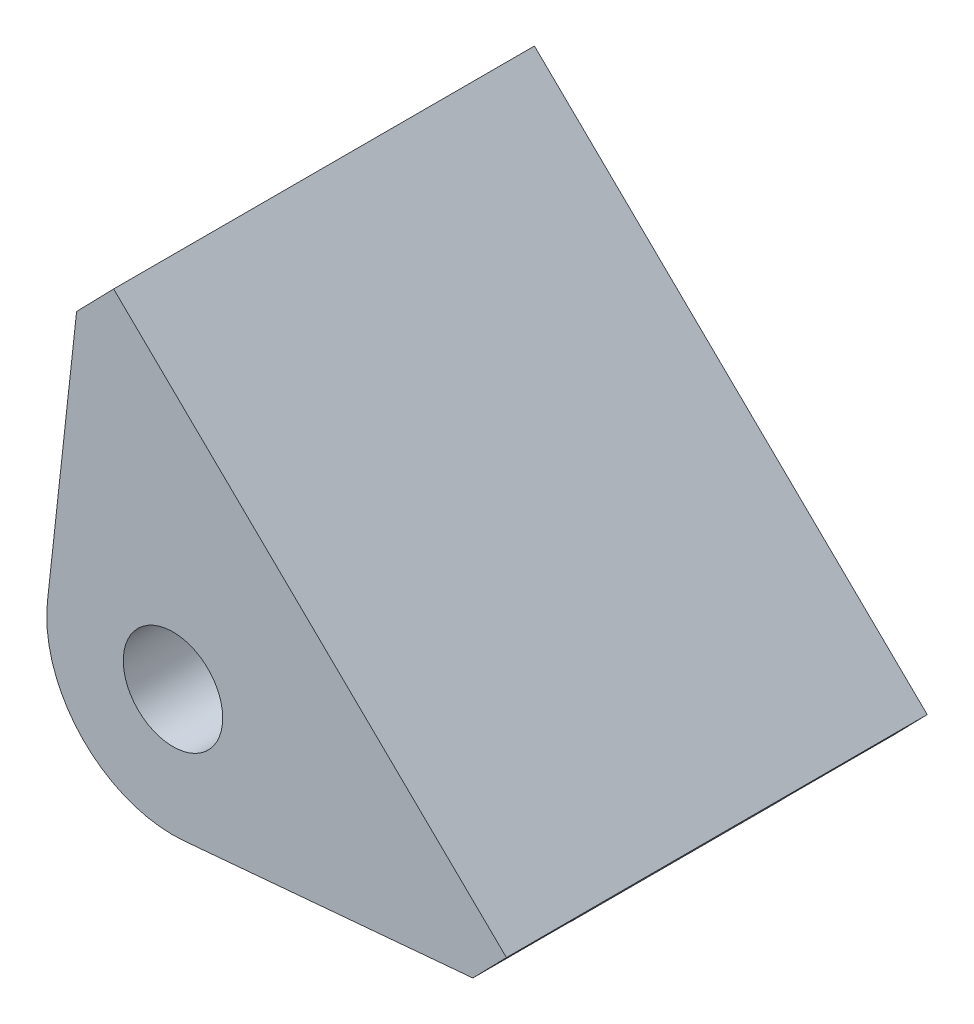
ISO-10303-21;
HEADER;
FILE_DESCRIPTION(('STEP AP214'),'2;1');
FILE_NAME('part.step','',(''),(''),'','','');
FILE_SCHEMA(('AUTOMOTIVE_DESIGN { 1 0 10303 214 1 1 1 1 }'));
ENDSEC;
DATA;
#1=APPLICATION_CONTEXT('core data for automotive mechanical design processes');
#2=APPLICATION_PROTOCOL_DEFINITION('international standard','automotive_design',2000,#1);
#3=PRODUCT_CONTEXT('',#1,'mechanical');
#4=PRODUCT('Part','Part','',(#3));
#5=PRODUCT_RELATED_PRODUCT_CATEGORY('part','',(#4));
#6=PRODUCT_DEFINITION_FORMATION('','',#4);
#7=PRODUCT_DEFINITION_CONTEXT('part definition',#1,'design');
#8=PRODUCT_DEFINITION('design','',#6,#7);
#9=PRODUCT_DEFINITION_SHAPE('','',#8);
#10=(LENGTH_UNIT() NAMED_UNIT(*) SI_UNIT(.MILLI.,.METRE.));
#11=(NAMED_UNIT(*) PLANE_ANGLE_UNIT() SI_UNIT($,.RADIAN.));
#12=(NAMED_UNIT(*) SI_UNIT($,.STERADIAN.) SOLID_ANGLE_UNIT());
#13=UNCERTAINTY_MEASURE_WITH_UNIT(LENGTH_MEASURE(1.E-05),#10,'distance_accuracy_value','');
#14=(GEOMETRIC_REPRESENTATION_CONTEXT(3) GLOBAL_UNCERTAINTY_ASSIGNED_CONTEXT((#13)) GLOBAL_UNIT_ASSIGNED_CONTEXT((#10,
#11,#12)) REPRESENTATION_CONTEXT('',''));
#15=CARTESIAN_POINT('',(0.,0.,0.));
#16=DIRECTION('',(0.,0.,1.));
#17=DIRECTION('',(1.,0.,0.));
#18=AXIS2_PLACEMENT_3D('',#15,#16,#17);
#19=CARTESIAN_POINT('',(-1485.6042340295,163.072759468048,12.7));
#20=DIRECTION('',(0.994029324943426,-0.109113249207034,0.));
#21=DIRECTION('',(0.109113249207034,0.994029324943426,0.));
#22=AXIS2_PLACEMENT_3D('',#19,#20,#21);
#23=PLANE('',#22);
#24=DIRECTION('',(0.,0.,1.));
#25=VECTOR('',#24,1.);
#26=CARTESIAN_POINT('',(-1426.53429907926,701.20399458166,12.7));
#27=LINE('',#26,#25);
#28=CARTESIAN_POINT('',(-1426.53429907926,701.20399458166,0.));
#29=VERTEX_POINT('',#28);
#30=CARTESIAN_POINT('',(-1426.53429907926,701.203994581659,12.7));
#31=VERTEX_POINT('',#30);
#32=EDGE_CURVE('E55',#29,#31,#27,.T.);
#33=ORIENTED_EDGE('',*,*,#32,.F.);
#34=DIRECTION('',(-0.109113249207034,-0.994029324943426,0.));
#35=VECTOR('',#34,1.);
#36=CARTESIAN_POINT('',(-1485.6042340295,163.072759468048,0.));
#37=LINE('',#36,#35);
#38=CARTESIAN_POINT('',(-1426.64108778726,700.231141989519,0.));
#39=VERTEX_POINT('',#38);
#40=EDGE_CURVE('E235',#29,#39,#37,.T.);
#41=ORIENTED_EDGE('',*,*,#40,.T.);
#42=CARTESIAN_POINT('',(-1430.04928785572,669.182201206105,0.));
#43=VERTEX_POINT('',#42);
#44=EDGE_CURVE('E220',#39,#43,#37,.T.);
#45=ORIENTED_EDGE('',*,*,#44,.T.);
#46=DIRECTION('',(0.,0.,-1.));
#47=VECTOR('',#46,1.);
#48=CARTESIAN_POINT('',(-1430.04928785572,669.182201206105,12.7));
#49=LINE('',#48,#47);
#50=CARTESIAN_POINT('',(-1430.04928785572,669.182201206105,12.7));
#51=VERTEX_POINT('',#50);
#52=EDGE_CURVE('E245',#51,#43,#49,.T.);
#53=ORIENTED_EDGE('',*,*,#52,.F.);
#54=DIRECTION('',(-0.109113249207034,-0.994029324943426,0.));
#55=VECTOR('',#54,1.);
#56=CARTESIAN_POINT('',(-1485.6042340295,163.072759468048,12.7));
#57=LINE('',#56,#55);
#58=EDGE_CURVE('E221',#31,#51,#57,.T.);
#59=ORIENTED_EDGE('',*,*,#58,.F.);
#60=EDGE_LOOP('',(#33,#41,#45,#53,#59));
#61=FACE_BOUND('',#60,.T.);
#62=ADVANCED_FACE('F41',(#61),#23,.F.);
#63=CARTESIAN_POINT('',(-339.597460900784,-348.630615295482,12.7));
#64=DIRECTION('',(-0.697765739297027,-0.716326024281732,0.));
#65=DIRECTION('',(0.716326024281732,-0.697765739297027,0.));
#66=AXIS2_PLACEMENT_3D('',#63,#64,#65);
#67=PLANE('',#66);
#68=DIRECTION('',(-0.716326024281732,0.697765739297027,0.));
#69=VECTOR('',#68,1.);
#70=CARTESIAN_POINT('',(-339.597460900784,-348.630615295482,12.7));
#71=LINE('',#70,#69);
#72=CARTESIAN_POINT('',(-1374.64541926335,659.598849212548,12.7));
#73=VERTEX_POINT('',#72);
#74=CARTESIAN_POINT('',(-1422.0662020708,705.790941154011,12.7));
#75=VERTEX_POINT('',#74);
#76=EDGE_CURVE('E145',#73,#75,#71,.T.);
#77=ORIENTED_EDGE('',*,*,#76,.F.);
#78=DIRECTION('',(0.,0.,1.));
#79=VECTOR('',#78,1.);
#80=CARTESIAN_POINT('',(-1374.64541926335,659.598849212548,-25.4));
#81=LINE('',#80,#79);
#82=CARTESIAN_POINT('',(-1374.64541926335,659.598849212548,-38.1));
#83=VERTEX_POINT('',#82);
#84=EDGE_CURVE('E139',#83,#73,#81,.T.);
#85=ORIENTED_EDGE('',*,*,#84,.F.);
#86=DIRECTION('',(-0.716326024281732,0.697765739297027,0.));
#87=VECTOR('',#86,1.);
#88=CARTESIAN_POINT('',(-339.597460900784,-348.630615295482,-38.1));
#89=LINE('',#88,#87);
#90=CARTESIAN_POINT('',(-1422.0662020708,705.790941154011,-38.1));
#91=VERTEX_POINT('',#90);
#92=EDGE_CURVE('E143',#83,#91,#89,.T.);
#93=ORIENTED_EDGE('',*,*,#92,.T.);
#94=DIRECTION('',(0.,0.,1.));
#95=VECTOR('',#94,1.);
#96=CARTESIAN_POINT('',(-1422.0662020708,705.790941154011,-25.4));
#97=LINE('',#96,#95);
#98=EDGE_CURVE('E61',#91,#75,#97,.T.);
#99=ORIENTED_EDGE('',*,*,#98,.T.);
#100=EDGE_LOOP('',(#77,#85,#93,#99));
#101=FACE_BOUND('',#100,.T.);
#102=ADVANCED_FACE('F141',(#101),#67,.F.);
#103=CARTESIAN_POINT('',(0.,0.,12.7));
#104=DIRECTION('',(0.,0.,1.));
#105=DIRECTION('',(1.,0.,0.));
#106=AXIS2_PLACEMENT_3D('',#103,#104,#105);
#107=PLANE('',#106);
#108=DIRECTION('',(0.697765739296999,0.716326024281759,0.));
#109=VECTOR('',#108,1.);
#110=CARTESIAN_POINT('',(-1035.04795836262,1008.229464508,12.7));
#111=LINE('',#110,#109);
#112=CARTESIAN_POINT('',(-1378.70440661382,655.43189444876,12.7));
#113=VERTEX_POINT('',#112);
#114=EDGE_CURVE('E159',#113,#73,#111,.T.);
#115=ORIENTED_EDGE('',*,*,#114,.T.);
#116=ORIENTED_EDGE('',*,*,#76,.T.);
#117=DIRECTION('',(0.697765739297038,0.716326024281722,0.));
#118=VECTOR('',#117,1.);
#119=CARTESIAN_POINT('',(-1427.07255077783,700.651425606737,12.7));
#120=LINE('',#119,#118);
#121=EDGE_CURVE('E160',#31,#75,#120,.T.);
#122=ORIENTED_EDGE('',*,*,#121,.F.);
#123=ORIENTED_EDGE('',*,*,#58,.T.);
#124=CARTESIAN_POINT('',(-1414.90028094358,667.519315288189,12.7));
#125=DIRECTION('',(0.,0.,1.));
#126=DIRECTION('',(1.,0.,0.));
#127=AXIS2_PLACEMENT_3D('',#124,#125,#126);
#128=CIRCLE('',#127,15.24);
#129=CARTESIAN_POINT('',(-1413.55298448154,652.338986166481,12.7));
#130=VERTEX_POINT('',#129);
#131=EDGE_CURVE('E223',#51,#130,#128,.T.);
#132=ORIENTED_EDGE('',*,*,#131,.T.);
#133=DIRECTION('',(0.996084588038588,0.088405279661318,0.));
#134=VECTOR('',#133,1.);
#135=CARTESIAN_POINT('',(-68.4920219965317,771.716890390617,12.7));
#136=LINE('',#135,#134);
#137=EDGE_CURVE('E226',#130,#113,#136,.T.);
#138=ORIENTED_EDGE('',*,*,#137,.T.);
#139=EDGE_LOOP('',(#115,#116,#122,#123,#132,#138));
#140=FACE_BOUND('',#139,.T.);
#141=CARTESIAN_POINT('',(-1414.90028094358,667.519315288189,12.7));
#142=DIRECTION('',(0.,0.,1.));
#143=DIRECTION('',(1.,0.,0.));
#144=AXIS2_PLACEMENT_3D('',#141,#142,#143);
#145=CIRCLE('',#144,6.0007499999999);
#146=CARTESIAN_POINT('',(-1408.89953094358,667.519315288189,12.7));
#147=VERTEX_POINT('',#146);
#148=EDGE_CURVE('E230',#147,#147,#145,.T.);
#149=ORIENTED_EDGE('',*,*,#148,.F.);
#150=EDGE_LOOP('',(#149));
#151=FACE_BOUND('',#150,.T.);
#152=ADVANCED_FACE('F280',(#140,#151),#107,.T.);
#153=CARTESIAN_POINT('',(-1485.6042340295,163.072759468048,-38.1));
#154=DIRECTION('',(-0.994029324943426,0.109113249207034,0.));
#155=DIRECTION('',(-0.109113249207034,-0.994029324943426,0.));
#156=AXIS2_PLACEMENT_3D('',#153,#154,#155);
#157=PLANE('',#156);
#158=DIRECTION('',(-0.109113249207034,-0.994029324943426,0.));
#159=VECTOR('',#158,1.);
#160=CARTESIAN_POINT('',(-1485.6042340295,163.072759468048,-25.4));
#161=LINE('',#160,#159);
#162=CARTESIAN_POINT('',(-1426.53429907926,701.20399458166,-25.4));
#163=VERTEX_POINT('',#162);
#164=CARTESIAN_POINT('',(-1426.64108778726,700.231141989519,-25.4));
#165=VERTEX_POINT('',#164);
#166=EDGE_CURVE('E48',#163,#165,#161,.T.);
#167=ORIENTED_EDGE('',*,*,#166,.F.);
#168=DIRECTION('',(0.,0.,-1.));
#169=VECTOR('',#168,1.);
#170=CARTESIAN_POINT('',(-1426.53429907926,701.20399458166,-38.1));
#171=LINE('',#170,#169);
#172=CARTESIAN_POINT('',(-1426.53429907926,701.20399458166,-38.1));
#173=VERTEX_POINT('',#172);
#174=EDGE_CURVE('E287',#163,#173,#171,.T.);
#175=ORIENTED_EDGE('',*,*,#174,.T.);
#176=DIRECTION('',(-0.109113249207034,-0.994029324943426,0.));
#177=VECTOR('',#176,1.);
#178=CARTESIAN_POINT('',(-1485.6042340295,163.072759468048,-38.1));
#179=LINE('',#178,#177);
#180=CARTESIAN_POINT('',(-1430.04928785572,669.182201206105,-38.1));
#181=VERTEX_POINT('',#180);
#182=EDGE_CURVE('E166',#173,#181,#179,.T.);
#183=ORIENTED_EDGE('',*,*,#182,.T.);
#184=DIRECTION('',(0.,0.,1.));
#185=VECTOR('',#184,1.);
#186=CARTESIAN_POINT('',(-1430.04928785572,669.182201206105,-38.1));
#187=LINE('',#186,#185);
#188=CARTESIAN_POINT('',(-1430.04928785572,669.182201206105,-25.4));
#189=VERTEX_POINT('',#188);
#190=EDGE_CURVE('E179',#181,#189,#187,.T.);
#191=ORIENTED_EDGE('',*,*,#190,.T.);
#192=EDGE_CURVE('E180',#165,#189,#161,.T.);
#193=ORIENTED_EDGE('',*,*,#192,.F.);
#194=EDGE_LOOP('',(#167,#175,#183,#191,#193));
#195=FACE_BOUND('',#194,.T.);
#196=ADVANCED_FACE('F291',(#195),#157,.T.);
#197=CARTESIAN_POINT('',(0.,0.,-38.1));
#198=DIRECTION('',(0.,0.,-1.));
#199=DIRECTION('',(1.,0.,0.));
#200=AXIS2_PLACEMENT_3D('',#197,#198,#199);
#201=PLANE('',#200);
#202=DIRECTION('',(0.697765739296999,0.716326024281759,0.));
#203=VECTOR('',#202,1.);
#204=CARTESIAN_POINT('',(-1035.04795836262,1008.229464508,-38.1));
#205=LINE('',#204,#203);
#206=CARTESIAN_POINT('',(-1378.70440661382,655.43189444876,-38.1));
#207=VERTEX_POINT('',#206);
#208=EDGE_CURVE('E151',#207,#83,#205,.T.);
#209=ORIENTED_EDGE('',*,*,#208,.F.);
#210=DIRECTION('',(0.996084588038588,0.088405279661318,0.));
#211=VECTOR('',#210,1.);
#212=CARTESIAN_POINT('',(-68.4920219965317,771.716890390617,-38.1));
#213=LINE('',#212,#211);
#214=CARTESIAN_POINT('',(-1413.55298448154,652.338986166481,-38.1));
#215=VERTEX_POINT('',#214);
#216=EDGE_CURVE('E165',#215,#207,#213,.T.);
#217=ORIENTED_EDGE('',*,*,#216,.F.);
#218=CARTESIAN_POINT('',(-1414.90028094358,667.519315288189,-38.1));
#219=DIRECTION('',(0.,0.,1.));
#220=DIRECTION('',(1.,0.,0.));
#221=AXIS2_PLACEMENT_3D('',#218,#219,#220);
#222=CIRCLE('',#221,15.24);
#223=EDGE_CURVE('E168',#181,#215,#222,.T.);
#224=ORIENTED_EDGE('',*,*,#223,.F.);
#225=ORIENTED_EDGE('',*,*,#182,.F.);
#226=DIRECTION('',(0.697765739297038,0.716326024281722,0.));
#227=VECTOR('',#226,1.);
#228=CARTESIAN_POINT('',(-1082.46874117,1054.4215564495,-38.1));
#229=LINE('',#228,#227);
#230=EDGE_CURVE('E12',#173,#91,#229,.T.);
#231=ORIENTED_EDGE('',*,*,#230,.T.);
#232=ORIENTED_EDGE('',*,*,#92,.F.);
#233=EDGE_LOOP('',(#209,#217,#224,#225,#231,#232));
#234=FACE_BOUND('',#233,.T.);
#235=CARTESIAN_POINT('',(-1414.90028094358,667.519315288189,-38.1));
#236=DIRECTION('',(0.,0.,1.));
#237=DIRECTION('',(1.,0.,0.));
#238=AXIS2_PLACEMENT_3D('',#235,#236,#237);
#239=CIRCLE('',#238,6.0007499999999);
#240=CARTESIAN_POINT('',(-1408.89953094358,667.519315288189,-38.1));
#241=VERTEX_POINT('',#240);
#242=EDGE_CURVE('E176',#241,#241,#239,.T.);
#243=ORIENTED_EDGE('',*,*,#242,.T.);
#244=EDGE_LOOP('',(#243));
#245=FACE_BOUND('',#244,.T.);
#246=ADVANCED_FACE('F162',(#234,#245),#201,.T.);
#247=CARTESIAN_POINT('',(0.,0.,-25.4));
#248=DIRECTION('',(0.,0.,-1.));
#249=DIRECTION('',(-1.,0.,0.));
#250=AXIS2_PLACEMENT_3D('',#247,#248,#249);
#251=PLANE('',#250);
#252=DIRECTION('',(0.697765739297023,0.716326024281737,0.));
#253=VECTOR('',#252,1.);
#254=CARTESIAN_POINT('',(-1082.46874117003,1054.42155644949,-25.4));
#255=LINE('',#254,#253);
#256=CARTESIAN_POINT('',(-1427.07255077783,700.651425606737,-25.4));
#257=VERTEX_POINT('',#256);
#258=EDGE_CURVE('E148',#257,#163,#255,.T.);
#259=ORIENTED_EDGE('',*,*,#258,.T.);
#260=ORIENTED_EDGE('',*,*,#166,.T.);
#261=DIRECTION('',(-0.71632602428173,0.69776573929703,0.));
#262=VECTOR('',#261,1.);
#263=CARTESIAN_POINT('',(-344.603809607816,-353.770130842759,-25.4));
#264=LINE('',#263,#262);
#265=EDGE_CURVE('E198',#165,#257,#264,.T.);
#266=ORIENTED_EDGE('',*,*,#265,.T.);
#267=EDGE_LOOP('',(#259,#260,#266));
#268=FACE_BOUND('',#267,.T.);
#269=ADVANCED_FACE('F302',(#268),#251,.T.);
#270=CARTESIAN_POINT('',(-1379.65176797038,654.459333665273,-25.4));
#271=VERTEX_POINT('',#270);
#272=CARTESIAN_POINT('',(-1380.48771488953,655.273620875682,-25.4));
#273=VERTEX_POINT('',#272);
#274=EDGE_CURVE('E200',#271,#273,#264,.T.);
#275=ORIENTED_EDGE('',*,*,#274,.T.);
#276=DIRECTION('',(0.996084588038588,0.088405279661318,0.));
#277=VECTOR('',#276,1.);
#278=CARTESIAN_POINT('',(-68.4920219965317,771.716890390617,-25.4));
#279=LINE('',#278,#277);
#280=CARTESIAN_POINT('',(-1378.70440661382,655.43189444876,-25.4));
#281=VERTEX_POINT('',#280);
#282=EDGE_CURVE('E186',#273,#281,#279,.T.);
#283=ORIENTED_EDGE('',*,*,#282,.T.);
#284=DIRECTION('',(0.697765739297031,0.716326024281729,0.));
#285=VECTOR('',#284,1.);
#286=CARTESIAN_POINT('',(-1035.04795836256,1008.22946450803,-25.4));
#287=LINE('',#286,#285);
#288=EDGE_CURVE('E196',#271,#281,#287,.T.);
#289=ORIENTED_EDGE('',*,*,#288,.F.);
#290=EDGE_LOOP('',(#275,#283,#289));
#291=FACE_BOUND('',#290,.T.);
#292=ADVANCED_FACE('F310',(#291),#251,.T.);
#293=CARTESIAN_POINT('',(0.,0.,0.));
#294=DIRECTION('',(0.,0.,1.));
#295=DIRECTION('',(1.,0.,0.));
#296=AXIS2_PLACEMENT_3D('',#293,#294,#295);
#297=PLANE('',#296);
#298=CARTESIAN_POINT('',(-1414.90028094358,667.519315288189,0.));
#299=DIRECTION('',(0.,0.,1.));
#300=DIRECTION('',(1.,0.,0.));
#301=AXIS2_PLACEMENT_3D('',#298,#299,#300);
#302=CIRCLE('',#301,6.0007499999999);
#303=CARTESIAN_POINT('',(-1408.89953094358,667.519315288189,0.));
#304=VERTEX_POINT('',#303);
#305=EDGE_CURVE('E224',#304,#304,#302,.T.);
#306=ORIENTED_EDGE('',*,*,#305,.T.);
#307=EDGE_LOOP('',(#306));
#308=FACE_BOUND('',#307,.T.);
#309=DIRECTION('',(-0.71632602428173,0.69776573929703,0.));
#310=VECTOR('',#309,1.);
#311=CARTESIAN_POINT('',(-344.603809607816,-353.770130842759,0.));
#312=LINE('',#311,#310);
#313=CARTESIAN_POINT('',(-1380.48771488953,655.273620875682,0.));
#314=VERTEX_POINT('',#313);
#315=EDGE_CURVE('E212',#314,#39,#312,.T.);
#316=ORIENTED_EDGE('',*,*,#315,.F.);
#317=DIRECTION('',(0.996084588038588,0.088405279661318,0.));
#318=VECTOR('',#317,1.);
#319=CARTESIAN_POINT('',(-68.4920219965317,771.716890390617,0.));
#320=LINE('',#319,#318);
#321=CARTESIAN_POINT('',(-1413.55298448154,652.338986166481,0.));
#322=VERTEX_POINT('',#321);
#323=EDGE_CURVE('E239',#322,#314,#320,.T.);
#324=ORIENTED_EDGE('',*,*,#323,.F.);
#325=CARTESIAN_POINT('',(-1414.90028094358,667.519315288189,0.));
#326=DIRECTION('',(0.,0.,1.));
#327=DIRECTION('',(1.,0.,0.));
#328=AXIS2_PLACEMENT_3D('',#325,#326,#327);
#329=CIRCLE('',#328,15.24);
#330=EDGE_CURVE('E236',#43,#322,#329,.T.);
#331=ORIENTED_EDGE('',*,*,#330,.F.);
#332=ORIENTED_EDGE('',*,*,#44,.F.);
#333=EDGE_LOOP('',(#316,#324,#331,#332));
#334=FACE_BOUND('',#333,.T.);
#335=ADVANCED_FACE('F268',(#308,#334),#297,.F.);
#336=CARTESIAN_POINT('',(-1414.90028094358,667.519315288189,12.7));
#337=DIRECTION('',(0.,0.,-1.));
#338=DIRECTION('',(-1.,0.,0.));
#339=AXIS2_PLACEMENT_3D('',#336,#337,#338);
#340=CYLINDRICAL_SURFACE('',#339,15.24);
#341=ORIENTED_EDGE('',*,*,#330,.T.);
#342=DIRECTION('',(0.,0.,-1.));
#343=VECTOR('',#342,1.);
#344=CARTESIAN_POINT('',(-1413.55298448154,652.338986166481,12.7));
#345=LINE('',#344,#343);
#346=EDGE_CURVE('E233',#130,#322,#345,.T.);
#347=ORIENTED_EDGE('',*,*,#346,.F.);
#348=ORIENTED_EDGE('',*,*,#131,.F.);
#349=ORIENTED_EDGE('',*,*,#52,.T.);
#350=EDGE_LOOP('',(#341,#347,#348,#349));
#351=FACE_BOUND('',#350,.T.);
#352=ADVANCED_FACE('F271',(#351),#340,.T.);
#353=CARTESIAN_POINT('',(-68.4920219965317,771.716890390617,12.7));
#354=DIRECTION('',(-0.088405279661318,0.996084588038588,0.));
#355=DIRECTION('',(-0.996084588038588,-0.088405279661318,0.));
#356=AXIS2_PLACEMENT_3D('',#353,#354,#355);
#357=PLANE('',#356);
#358=CARTESIAN_POINT('',(-1378.70440661382,655.43189444876,0.));
#359=VERTEX_POINT('',#358);
#360=EDGE_CURVE('E238',#314,#359,#320,.T.);
#361=ORIENTED_EDGE('',*,*,#360,.T.);
#362=DIRECTION('',(0.,0.,1.));
#363=VECTOR('',#362,1.);
#364=CARTESIAN_POINT('',(-1378.70440661382,655.43189444876,12.7));
#365=LINE('',#364,#363);
#366=EDGE_CURVE('E278',#359,#113,#365,.T.);
#367=ORIENTED_EDGE('',*,*,#366,.T.);
#368=ORIENTED_EDGE('',*,*,#137,.F.);
#369=ORIENTED_EDGE('',*,*,#346,.T.);
#370=ORIENTED_EDGE('',*,*,#323,.T.);
#371=EDGE_LOOP('',(#361,#367,#368,#369,#370));
#372=FACE_BOUND('',#371,.T.);
#373=ADVANCED_FACE('F275',(#372),#357,.F.);
#374=CARTESIAN_POINT('',(-1414.90028094358,667.519315288189,12.7));
#375=DIRECTION('',(0.,0.,-1.));
#376=DIRECTION('',(-1.,0.,0.));
#377=AXIS2_PLACEMENT_3D('',#374,#375,#376);
#378=CYLINDRICAL_SURFACE('',#377,6.0007499999999);
#379=ORIENTED_EDGE('',*,*,#148,.T.);
#380=EDGE_LOOP('',(#379));
#381=FACE_BOUND('',#380,.T.);
#382=ORIENTED_EDGE('',*,*,#305,.F.);
#383=EDGE_LOOP('',(#382));
#384=FACE_BOUND('',#383,.T.);
#385=ADVANCED_FACE('F325',(#381,#384),#378,.F.);
#386=CARTESIAN_POINT('',(0.,0.,0.));
#387=DIRECTION('',(0.,0.,-1.));
#388=DIRECTION('',(-1.,0.,0.));
#389=AXIS2_PLACEMENT_3D('',#386,#387,#388);
#390=PLANE('',#389);
#391=ORIENTED_EDGE('',*,*,#40,.F.);
#392=DIRECTION('',(0.697765739297023,0.716326024281737,0.));
#393=VECTOR('',#392,1.);
#394=CARTESIAN_POINT('',(-1082.46874117003,1054.42155644949,0.));
#395=LINE('',#394,#393);
#396=CARTESIAN_POINT('',(-1427.07255077783,700.651425606737,0.));
#397=VERTEX_POINT('',#396);
#398=EDGE_CURVE('E199',#397,#29,#395,.T.);
#399=ORIENTED_EDGE('',*,*,#398,.F.);
#400=EDGE_CURVE('E208',#39,#397,#312,.T.);
#401=ORIENTED_EDGE('',*,*,#400,.F.);
#402=EDGE_LOOP('',(#391,#399,#401));
#403=FACE_BOUND('',#402,.T.);
#404=ADVANCED_FACE('F262',(#403),#390,.F.);
#405=CARTESIAN_POINT('',(-1035.04795836256,1008.22946450803,-25.4));
#406=DIRECTION('',(0.716326024281729,-0.697765739297031,0.));
#407=DIRECTION('',(0.697765739297031,0.716326024281729,0.));
#408=AXIS2_PLACEMENT_3D('',#405,#406,#407);
#409=PLANE('',#408);
#410=DIRECTION('',(0.697765739297031,0.716326024281729,0.));
#411=VECTOR('',#410,1.);
#412=CARTESIAN_POINT('',(-1035.04795836256,1008.22946450803,0.));
#413=LINE('',#412,#411);
#414=CARTESIAN_POINT('',(-1379.65176797038,654.459333665273,0.));
#415=VERTEX_POINT('',#414);
#416=EDGE_CURVE('E195',#415,#359,#413,.T.);
#417=ORIENTED_EDGE('',*,*,#416,.F.);
#418=DIRECTION('',(0.,0.,1.));
#419=VECTOR('',#418,1.);
#420=CARTESIAN_POINT('',(-1379.65176797038,654.459333665273,-25.4));
#421=LINE('',#420,#419);
#422=EDGE_CURVE('E218',#271,#415,#421,.T.);
#423=ORIENTED_EDGE('',*,*,#422,.F.);
#424=ORIENTED_EDGE('',*,*,#288,.T.);
#425=DIRECTION('',(0.,0.,-1.));
#426=VECTOR('',#425,1.);
#427=CARTESIAN_POINT('',(-1378.70440661382,655.43189444876,-38.1));
#428=LINE('',#427,#426);
#429=EDGE_CURVE('E155',#281,#207,#428,.T.);
#430=ORIENTED_EDGE('',*,*,#429,.T.);
#431=ORIENTED_EDGE('',*,*,#208,.T.);
#432=ORIENTED_EDGE('',*,*,#84,.T.);
#433=ORIENTED_EDGE('',*,*,#114,.F.);
#434=ORIENTED_EDGE('',*,*,#366,.F.);
#435=EDGE_LOOP('',(#417,#423,#424,#430,#431,#432,#433,#434));
#436=FACE_BOUND('',#435,.T.);
#437=ADVANCED_FACE('F153',(#436),#409,.T.);
#438=CARTESIAN_POINT('',(-344.603809607816,-353.770130842759,-25.4));
#439=DIRECTION('',(0.69776573929703,0.716326024281729,0.));
#440=DIRECTION('',(-0.71632602428173,0.69776573929703,0.));
#441=AXIS2_PLACEMENT_3D('',#438,#439,#440);
#442=PLANE('',#441);
#443=EDGE_CURVE('E209',#415,#314,#312,.T.);
#444=ORIENTED_EDGE('',*,*,#443,.T.);
#445=ORIENTED_EDGE('',*,*,#315,.T.);
#446=ORIENTED_EDGE('',*,*,#400,.T.);
#447=DIRECTION('',(0.,0.,1.));
#448=VECTOR('',#447,1.);
#449=CARTESIAN_POINT('',(-1427.07255077783,700.651425606737,-25.4));
#450=LINE('',#449,#448);
#451=EDGE_CURVE('E215',#257,#397,#450,.T.);
#452=ORIENTED_EDGE('',*,*,#451,.F.);
#453=ORIENTED_EDGE('',*,*,#265,.F.);
#454=EDGE_CURVE('E203',#273,#165,#264,.T.);
#455=ORIENTED_EDGE('',*,*,#454,.F.);
#456=ORIENTED_EDGE('',*,*,#274,.F.);
#457=ORIENTED_EDGE('',*,*,#422,.T.);
#458=EDGE_LOOP('',(#444,#445,#446,#452,#453,#455,#456,#457));
#459=FACE_BOUND('',#458,.T.);
#460=ADVANCED_FACE('F255',(#459),#442,.F.);
#461=CARTESIAN_POINT('',(-1082.46874117003,1054.42155644949,-25.4));
#462=DIRECTION('',(0.716326024281737,-0.697765739297023,0.));
#463=DIRECTION('',(0.697765739297023,0.716326024281737,0.));
#464=AXIS2_PLACEMENT_3D('',#461,#462,#463);
#465=PLANE('',#464);
#466=ORIENTED_EDGE('',*,*,#398,.T.);
#467=ORIENTED_EDGE('',*,*,#32,.T.);
#468=ORIENTED_EDGE('',*,*,#121,.T.);
#469=ORIENTED_EDGE('',*,*,#98,.F.);
#470=ORIENTED_EDGE('',*,*,#230,.F.);
#471=ORIENTED_EDGE('',*,*,#174,.F.);
#472=ORIENTED_EDGE('',*,*,#258,.F.);
#473=ORIENTED_EDGE('',*,*,#451,.T.);
#474=EDGE_LOOP('',(#466,#467,#468,#469,#470,#471,#472,#473));
#475=FACE_BOUND('',#474,.T.);
#476=ADVANCED_FACE('F261',(#475),#465,.F.);
#477=ORIENTED_EDGE('',*,*,#360,.F.);
#478=ORIENTED_EDGE('',*,*,#443,.F.);
#479=ORIENTED_EDGE('',*,*,#416,.T.);
#480=EDGE_LOOP('',(#477,#478,#479));
#481=FACE_BOUND('',#480,.T.);
#482=ADVANCED_FACE('F313',(#481),#390,.F.);
#483=CARTESIAN_POINT('',(0.,0.,-25.4));
#484=DIRECTION('',(0.,0.,-1.));
#485=DIRECTION('',(1.,0.,0.));
#486=AXIS2_PLACEMENT_3D('',#483,#484,#485);
#487=PLANE('',#486);
#488=CARTESIAN_POINT('',(-1414.90028094358,667.519315288189,-25.4));
#489=DIRECTION('',(0.,0.,1.));
#490=DIRECTION('',(1.,0.,0.));
#491=AXIS2_PLACEMENT_3D('',#488,#489,#490);
#492=CIRCLE('',#491,6.0007499999999);
#493=CARTESIAN_POINT('',(-1408.89953094358,667.519315288189,-25.4));
#494=VERTEX_POINT('',#493);
#495=EDGE_CURVE('E170',#494,#494,#492,.T.);
#496=ORIENTED_EDGE('',*,*,#495,.F.);
#497=EDGE_LOOP('',(#496));
#498=FACE_BOUND('',#497,.T.);
#499=CARTESIAN_POINT('',(-1413.55298448154,652.338986166481,-25.4));
#500=VERTEX_POINT('',#499);
#501=EDGE_CURVE('E182',#500,#273,#279,.T.);
#502=ORIENTED_EDGE('',*,*,#501,.T.);
#503=ORIENTED_EDGE('',*,*,#454,.T.);
#504=ORIENTED_EDGE('',*,*,#192,.T.);
#505=CARTESIAN_POINT('',(-1414.90028094358,667.519315288189,-25.4));
#506=DIRECTION('',(0.,0.,1.));
#507=DIRECTION('',(1.,0.,0.));
#508=AXIS2_PLACEMENT_3D('',#505,#506,#507);
#509=CIRCLE('',#508,15.24);
#510=EDGE_CURVE('E185',#189,#500,#509,.T.);
#511=ORIENTED_EDGE('',*,*,#510,.T.);
#512=EDGE_LOOP('',(#502,#503,#504,#511));
#513=FACE_BOUND('',#512,.T.);
#514=ADVANCED_FACE('F305',(#498,#513),#487,.F.);
#515=CARTESIAN_POINT('',(-68.4920219965317,771.716890390617,-38.1));
#516=DIRECTION('',(0.088405279661318,-0.996084588038588,0.));
#517=DIRECTION('',(0.996084588038588,0.088405279661318,0.));
#518=AXIS2_PLACEMENT_3D('',#515,#516,#517);
#519=PLANE('',#518);
#520=ORIENTED_EDGE('',*,*,#429,.F.);
#521=ORIENTED_EDGE('',*,*,#282,.F.);
#522=ORIENTED_EDGE('',*,*,#501,.F.);
#523=DIRECTION('',(0.,0.,1.));
#524=VECTOR('',#523,1.);
#525=CARTESIAN_POINT('',(-1413.55298448154,652.338986166481,-38.1));
#526=LINE('',#525,#524);
#527=EDGE_CURVE('E193',#215,#500,#526,.T.);
#528=ORIENTED_EDGE('',*,*,#527,.F.);
#529=ORIENTED_EDGE('',*,*,#216,.T.);
#530=EDGE_LOOP('',(#520,#521,#522,#528,#529));
#531=FACE_BOUND('',#530,.T.);
#532=ADVANCED_FACE('F307',(#531),#519,.T.);
#533=CARTESIAN_POINT('',(-1414.90028094358,667.519315288189,-38.1));
#534=DIRECTION('',(0.,0.,1.));
#535=DIRECTION('',(1.,0.,0.));
#536=AXIS2_PLACEMENT_3D('',#533,#534,#535);
#537=CYLINDRICAL_SURFACE('',#536,15.24);
#538=ORIENTED_EDGE('',*,*,#510,.F.);
#539=ORIENTED_EDGE('',*,*,#190,.F.);
#540=ORIENTED_EDGE('',*,*,#223,.T.);
#541=ORIENTED_EDGE('',*,*,#527,.T.);
#542=EDGE_LOOP('',(#538,#539,#540,#541));
#543=FACE_BOUND('',#542,.T.);
#544=ADVANCED_FACE('F298',(#543),#537,.T.);
#545=CARTESIAN_POINT('',(-1414.90028094358,667.519315288189,-38.1));
#546=DIRECTION('',(0.,0.,1.));
#547=DIRECTION('',(1.,0.,0.));
#548=AXIS2_PLACEMENT_3D('',#545,#546,#547);
#549=CYLINDRICAL_SURFACE('',#548,6.0007499999999);
#550=ORIENTED_EDGE('',*,*,#242,.F.);
#551=EDGE_LOOP('',(#550));
#552=FACE_BOUND('',#551,.T.);
#553=ORIENTED_EDGE('',*,*,#495,.T.);
#554=EDGE_LOOP('',(#553));
#555=FACE_BOUND('',#554,.T.);
#556=ADVANCED_FACE('F390',(#552,#555),#549,.F.);
#557=CLOSED_SHELL('',(#62,#102,#152,#196,#246,#269,#292,#335,#352,#373,#385,#404,#437,#460,#476,
#482,#514,#532,#544,#556));
#558=MANIFOLD_SOLID_BREP('B2',#557);
#559=ADVANCED_BREP_SHAPE_REPRESENTATION('',(#18,#558),#14);
#560=SHAPE_DEFINITION_REPRESENTATION(#9,#559);
ENDSEC;
END-ISO-10303-21;
